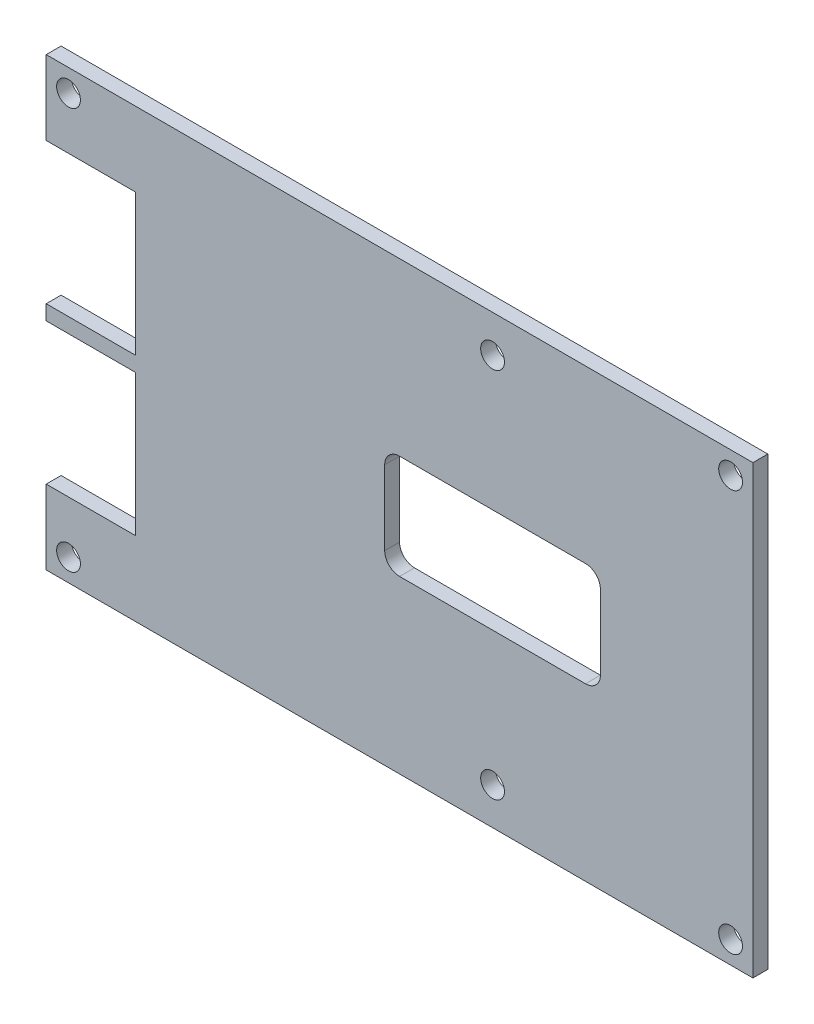
ISO-10303-21;
HEADER;
FILE_DESCRIPTION(('STEP AP214'),'2;1');
FILE_NAME('part.step','',(''),(''),'','','');
FILE_SCHEMA(('AUTOMOTIVE_DESIGN { 1 0 10303 214 1 1 1 1 }'));
ENDSEC;
DATA;
#1=APPLICATION_CONTEXT('core data for automotive mechanical design processes');
#2=APPLICATION_PROTOCOL_DEFINITION('international standard','automotive_design',2000,#1);
#3=PRODUCT_CONTEXT('',#1,'mechanical');
#4=PRODUCT('Part','Part','',(#3));
#5=PRODUCT_RELATED_PRODUCT_CATEGORY('part','',(#4));
#6=PRODUCT_DEFINITION_FORMATION('','',#4);
#7=PRODUCT_DEFINITION_CONTEXT('part definition',#1,'design');
#8=PRODUCT_DEFINITION('design','',#6,#7);
#9=PRODUCT_DEFINITION_SHAPE('','',#8);
#10=(LENGTH_UNIT() NAMED_UNIT(*) SI_UNIT(.MILLI.,.METRE.));
#11=(NAMED_UNIT(*) PLANE_ANGLE_UNIT() SI_UNIT($,.RADIAN.));
#12=(NAMED_UNIT(*) SI_UNIT($,.STERADIAN.) SOLID_ANGLE_UNIT());
#13=UNCERTAINTY_MEASURE_WITH_UNIT(LENGTH_MEASURE(1.E-05),#10,'distance_accuracy_value','');
#14=(GEOMETRIC_REPRESENTATION_CONTEXT(3) GLOBAL_UNCERTAINTY_ASSIGNED_CONTEXT((#13)) GLOBAL_UNIT_ASSIGNED_CONTEXT((#10,
#11,#12)) REPRESENTATION_CONTEXT('',''));
#15=CARTESIAN_POINT('',(0.,0.,0.));
#16=DIRECTION('',(0.,0.,1.));
#17=DIRECTION('',(1.,0.,0.));
#18=AXIS2_PLACEMENT_3D('',#15,#16,#17);
#19=CARTESIAN_POINT('',(0.,0.,2.));
#20=DIRECTION('',(0.,0.,1.));
#21=DIRECTION('',(1.,0.,0.));
#22=AXIS2_PLACEMENT_3D('',#19,#20,#21);
#23=PLANE('',#22);
#24=CARTESIAN_POINT('',(-36.5636368997673,-38.1185087890609,2.));
#25=DIRECTION('',(0.,0.,1.));
#26=DIRECTION('',(1.,0.,0.));
#27=AXIS2_PLACEMENT_3D('',#24,#25,#26);
#28=CIRCLE('',#27,1.6);
#29=CARTESIAN_POINT('',(-34.9636368997673,-38.1185087890609,2.));
#30=VERTEX_POINT('',#29);
#31=EDGE_CURVE('E243',#30,#30,#28,.T.);
#32=ORIENTED_EDGE('',*,*,#31,.F.);
#33=EDGE_LOOP('',(#32));
#34=FACE_BOUND('',#33,.T.);
#35=CARTESIAN_POINT('',(-36.5636368997673,15.8814912109391,2.));
#36=DIRECTION('',(0.,0.,1.));
#37=DIRECTION('',(1.,0.,0.));
#38=AXIS2_PLACEMENT_3D('',#35,#36,#37);
#39=CIRCLE('',#38,1.6);
#40=CARTESIAN_POINT('',(-34.9636368997673,15.8814912109391,2.));
#41=VERTEX_POINT('',#40);
#42=EDGE_CURVE('E255',#41,#41,#39,.T.);
#43=ORIENTED_EDGE('',*,*,#42,.F.);
#44=EDGE_LOOP('',(#43));
#45=FACE_BOUND('',#44,.T.);
#46=CARTESIAN_POINT('',(20.4363631002327,13.8814912109391,2.));
#47=DIRECTION('',(0.,0.,1.));
#48=DIRECTION('',(1.,0.,0.));
#49=AXIS2_PLACEMENT_3D('',#46,#47,#48);
#50=CIRCLE('',#49,1.6);
#51=CARTESIAN_POINT('',(22.0363631002327,13.8814912109391,2.));
#52=VERTEX_POINT('',#51);
#53=EDGE_CURVE('E267',#52,#52,#50,.T.);
#54=ORIENTED_EDGE('',*,*,#53,.F.);
#55=EDGE_LOOP('',(#54));
#56=FACE_BOUND('',#55,.T.);
#57=DIRECTION('',(0.,-1.,0.));
#58=VECTOR('',#57,1.);
#59=CARTESIAN_POINT('',(-39.5636368997673,18.8814912109391,2.));
#60=LINE('',#59,#58);
#61=CARTESIAN_POINT('',(-39.5636368997673,18.8814912109391,2.));
#62=VERTEX_POINT('',#61);
#63=CARTESIAN_POINT('',(-39.5636368997673,8.88149121093908,2.));
#64=VERTEX_POINT('',#63);
#65=EDGE_CURVE('E273',#62,#64,#60,.T.);
#66=ORIENTED_EDGE('',*,*,#65,.T.);
#67=DIRECTION('',(1.,0.,0.));
#68=VECTOR('',#67,1.);
#69=CARTESIAN_POINT('',(-39.5636368997673,8.88149121093908,2.));
#70=LINE('',#69,#68);
#71=CARTESIAN_POINT('',(-27.5636368997673,8.88149121093908,2.));
#72=VERTEX_POINT('',#71);
#73=EDGE_CURVE('E276',#64,#72,#70,.T.);
#74=ORIENTED_EDGE('',*,*,#73,.T.);
#75=DIRECTION('',(0.,-1.,0.));
#76=VECTOR('',#75,1.);
#77=CARTESIAN_POINT('',(-27.5636368997673,8.88149121093908,2.));
#78=LINE('',#77,#76);
#79=CARTESIAN_POINT('',(-27.5636368997673,-10.1185087890609,2.));
#80=VERTEX_POINT('',#79);
#81=EDGE_CURVE('E279',#72,#80,#78,.T.);
#82=ORIENTED_EDGE('',*,*,#81,.T.);
#83=DIRECTION('',(-1.,0.,0.));
#84=VECTOR('',#83,1.);
#85=CARTESIAN_POINT('',(-39.5636368997673,-10.1185087890609,2.));
#86=LINE('',#85,#84);
#87=CARTESIAN_POINT('',(-39.5636368997673,-10.1185087890609,2.));
#88=VERTEX_POINT('',#87);
#89=EDGE_CURVE('E281',#80,#88,#86,.T.);
#90=ORIENTED_EDGE('',*,*,#89,.T.);
#91=DIRECTION('',(0.,-1.,0.));
#92=VECTOR('',#91,1.);
#93=CARTESIAN_POINT('',(-39.5636368997673,-10.1185087890609,2.));
#94=LINE('',#93,#92);
#95=CARTESIAN_POINT('',(-39.5636368997673,-12.1185087890609,2.));
#96=VERTEX_POINT('',#95);
#97=EDGE_CURVE('E283',#88,#96,#94,.T.);
#98=ORIENTED_EDGE('',*,*,#97,.T.);
#99=DIRECTION('',(1.,0.,0.));
#100=VECTOR('',#99,1.);
#101=CARTESIAN_POINT('',(-39.5636368997673,-12.1185087890609,2.));
#102=LINE('',#101,#100);
#103=CARTESIAN_POINT('',(-27.5636368997673,-12.1185087890609,2.));
#104=VERTEX_POINT('',#103);
#105=EDGE_CURVE('E285',#96,#104,#102,.T.);
#106=ORIENTED_EDGE('',*,*,#105,.T.);
#107=DIRECTION('',(0.,-1.,0.));
#108=VECTOR('',#107,1.);
#109=CARTESIAN_POINT('',(-27.5636368997673,-12.1185087890609,2.));
#110=LINE('',#109,#108);
#111=CARTESIAN_POINT('',(-27.5636368997673,-31.1185087890609,2.));
#112=VERTEX_POINT('',#111);
#113=EDGE_CURVE('E287',#104,#112,#110,.T.);
#114=ORIENTED_EDGE('',*,*,#113,.T.);
#115=DIRECTION('',(-1.,0.,0.));
#116=VECTOR('',#115,1.);
#117=CARTESIAN_POINT('',(-39.5636368997673,-31.1185087890609,2.));
#118=LINE('',#117,#116);
#119=CARTESIAN_POINT('',(-39.5636368997673,-31.1185087890609,2.));
#120=VERTEX_POINT('',#119);
#121=EDGE_CURVE('E289',#112,#120,#118,.T.);
#122=ORIENTED_EDGE('',*,*,#121,.T.);
#123=DIRECTION('',(0.,-1.,0.));
#124=VECTOR('',#123,1.);
#125=CARTESIAN_POINT('',(-39.5636368997673,-31.1185087890609,2.));
#126=LINE('',#125,#124);
#127=CARTESIAN_POINT('',(-39.5636368997673,-41.1185087890609,2.));
#128=VERTEX_POINT('',#127);
#129=EDGE_CURVE('E291',#120,#128,#126,.T.);
#130=ORIENTED_EDGE('',*,*,#129,.T.);
#131=DIRECTION('',(1.,0.,0.));
#132=VECTOR('',#131,1.);
#133=CARTESIAN_POINT('',(-39.5636368997673,-41.1185087890609,2.));
#134=LINE('',#133,#132);
#135=CARTESIAN_POINT('',(55.4363631002327,-41.1185087890609,2.));
#136=VERTEX_POINT('',#135);
#137=EDGE_CURVE('E293',#128,#136,#134,.T.);
#138=ORIENTED_EDGE('',*,*,#137,.T.);
#139=DIRECTION('',(0.,1.,0.));
#140=VECTOR('',#139,1.);
#141=CARTESIAN_POINT('',(55.4363631002327,18.8814912109391,2.));
#142=LINE('',#141,#140);
#143=CARTESIAN_POINT('',(55.4363631002327,18.8814912109391,2.));
#144=VERTEX_POINT('',#143);
#145=EDGE_CURVE('E295',#136,#144,#142,.T.);
#146=ORIENTED_EDGE('',*,*,#145,.T.);
#147=DIRECTION('',(-1.,0.,0.));
#148=VECTOR('',#147,1.);
#149=CARTESIAN_POINT('',(-39.5636368997673,18.8814912109391,2.));
#150=LINE('',#149,#148);
#151=EDGE_CURVE('E297',#144,#62,#150,.T.);
#152=ORIENTED_EDGE('',*,*,#151,.T.);
#153=EDGE_LOOP('',(#66,#74,#82,#90,#98,#106,#114,#122,#130,#138,#146,#152));
#154=FACE_BOUND('',#153,.T.);
#155=CARTESIAN_POINT('',(20.4363631002327,-36.1185087890609,2.));
#156=DIRECTION('',(0.,0.,1.));
#157=DIRECTION('',(1.,0.,0.));
#158=AXIS2_PLACEMENT_3D('',#155,#156,#157);
#159=CIRCLE('',#158,1.6);
#160=CARTESIAN_POINT('',(22.0363631002327,-36.1185087890609,2.));
#161=VERTEX_POINT('',#160);
#162=EDGE_CURVE('E261',#161,#161,#159,.T.);
#163=ORIENTED_EDGE('',*,*,#162,.F.);
#164=EDGE_LOOP('',(#163));
#165=FACE_BOUND('',#164,.T.);
#166=CARTESIAN_POINT('',(52.4363631002327,15.8814912109391,2.));
#167=DIRECTION('',(0.,0.,1.));
#168=DIRECTION('',(1.,0.,0.));
#169=AXIS2_PLACEMENT_3D('',#166,#167,#168);
#170=CIRCLE('',#169,1.6);
#171=CARTESIAN_POINT('',(54.0363631002327,15.8814912109391,2.));
#172=VERTEX_POINT('',#171);
#173=EDGE_CURVE('E249',#172,#172,#170,.T.);
#174=ORIENTED_EDGE('',*,*,#173,.F.);
#175=EDGE_LOOP('',(#174));
#176=FACE_BOUND('',#175,.T.);
#177=CARTESIAN_POINT('',(52.4363631002327,-38.1185087890609,2.));
#178=DIRECTION('',(0.,0.,1.));
#179=DIRECTION('',(1.,0.,0.));
#180=AXIS2_PLACEMENT_3D('',#177,#178,#179);
#181=CIRCLE('',#180,1.6);
#182=CARTESIAN_POINT('',(54.0363631002327,-38.1185087890609,2.));
#183=VERTEX_POINT('',#182);
#184=EDGE_CURVE('E237',#183,#183,#181,.T.);
#185=ORIENTED_EDGE('',*,*,#184,.F.);
#186=EDGE_LOOP('',(#185));
#187=FACE_BOUND('',#186,.T.);
#188=DIRECTION('',(0.,-1.,0.));
#189=VECTOR('',#188,1.);
#190=CARTESIAN_POINT('',(5.93636310023267,-6.11850878906092,2.));
#191=LINE('',#190,#189);
#192=CARTESIAN_POINT('',(5.93636310023267,-6.11850878906092,2.));
#193=VERTEX_POINT('',#192);
#194=CARTESIAN_POINT('',(5.93636310023267,-16.1185087890609,2.));
#195=VERTEX_POINT('',#194);
#196=EDGE_CURVE('E180',#193,#195,#191,.T.);
#197=ORIENTED_EDGE('',*,*,#196,.F.);
#198=CARTESIAN_POINT('',(7.93636310023267,-6.11850878906092,2.));
#199=DIRECTION('',(0.,0.,1.));
#200=DIRECTION('',(1.,0.,0.));
#201=AXIS2_PLACEMENT_3D('',#198,#199,#200);
#202=CIRCLE('',#201,2.);
#203=CARTESIAN_POINT('',(7.93636310023267,-4.11850878906092,2.));
#204=VERTEX_POINT('',#203);
#205=EDGE_CURVE('E172',#204,#193,#202,.T.);
#206=ORIENTED_EDGE('',*,*,#205,.F.);
#207=DIRECTION('',(-1.,0.,0.));
#208=VECTOR('',#207,1.);
#209=CARTESIAN_POINT('',(7.93636310023267,-4.11850878906092,2.));
#210=LINE('',#209,#208);
#211=CARTESIAN_POINT('',(32.9363631002327,-4.11850878906091,2.));
#212=VERTEX_POINT('',#211);
#213=EDGE_CURVE('E205',#212,#204,#210,.T.);
#214=ORIENTED_EDGE('',*,*,#213,.F.);
#215=CARTESIAN_POINT('',(32.9363631002327,-6.11850878906092,2.));
#216=DIRECTION('',(0.,0.,1.));
#217=DIRECTION('',(1.,0.,0.));
#218=AXIS2_PLACEMENT_3D('',#215,#216,#217);
#219=CIRCLE('',#218,2.);
#220=CARTESIAN_POINT('',(34.9363631002327,-6.11850878906092,2.));
#221=VERTEX_POINT('',#220);
#222=EDGE_CURVE('E203',#221,#212,#219,.T.);
#223=ORIENTED_EDGE('',*,*,#222,.F.);
#224=DIRECTION('',(0.,1.,0.));
#225=VECTOR('',#224,1.);
#226=CARTESIAN_POINT('',(34.9363631002327,-6.11850878906092,2.));
#227=LINE('',#226,#225);
#228=CARTESIAN_POINT('',(34.9363631002327,-16.1185087890609,2.));
#229=VERTEX_POINT('',#228);
#230=EDGE_CURVE('E201',#229,#221,#227,.T.);
#231=ORIENTED_EDGE('',*,*,#230,.F.);
#232=CARTESIAN_POINT('',(32.9363631002327,-16.1185087890609,2.));
#233=DIRECTION('',(0.,0.,1.));
#234=DIRECTION('',(1.,0.,0.));
#235=AXIS2_PLACEMENT_3D('',#232,#233,#234);
#236=CIRCLE('',#235,2.);
#237=CARTESIAN_POINT('',(32.9363631002327,-18.1185087890609,2.));
#238=VERTEX_POINT('',#237);
#239=EDGE_CURVE('E199',#238,#229,#236,.T.);
#240=ORIENTED_EDGE('',*,*,#239,.F.);
#241=DIRECTION('',(1.,0.,0.));
#242=VECTOR('',#241,1.);
#243=CARTESIAN_POINT('',(7.93636310023267,-18.1185087890609,2.));
#244=LINE('',#243,#242);
#245=CARTESIAN_POINT('',(7.93636310023267,-18.1185087890609,2.));
#246=VERTEX_POINT('',#245);
#247=EDGE_CURVE('E195',#246,#238,#244,.T.);
#248=ORIENTED_EDGE('',*,*,#247,.F.);
#249=CARTESIAN_POINT('',(7.93636310023267,-16.1185087890609,2.));
#250=DIRECTION('',(0.,0.,1.));
#251=DIRECTION('',(-1.,0.,0.));
#252=AXIS2_PLACEMENT_3D('',#249,#250,#251);
#253=CIRCLE('',#252,2.);
#254=EDGE_CURVE('E193',#195,#246,#253,.T.);
#255=ORIENTED_EDGE('',*,*,#254,.F.);
#256=EDGE_LOOP('',(#197,#206,#214,#223,#231,#240,#248,#255));
#257=FACE_BOUND('',#256,.T.);
#258=ADVANCED_FACE('F35',(#34,#45,#56,#154,#165,#176,#187,#257),#23,.T.);
#259=CARTESIAN_POINT('',(0.,0.,0.));
#260=DIRECTION('',(0.,0.,1.));
#261=DIRECTION('',(1.,0.,0.));
#262=AXIS2_PLACEMENT_3D('',#259,#260,#261);
#263=PLANE('',#262);
#264=CARTESIAN_POINT('',(52.4363631002327,-38.1185087890609,0.));
#265=DIRECTION('',(0.,0.,1.));
#266=DIRECTION('',(1.,0.,0.));
#267=AXIS2_PLACEMENT_3D('',#264,#265,#266);
#268=CIRCLE('',#267,1.6);
#269=CARTESIAN_POINT('',(54.0363631002327,-38.1185087890609,0.));
#270=VERTEX_POINT('',#269);
#271=EDGE_CURVE('E188',#270,#270,#268,.T.);
#272=ORIENTED_EDGE('',*,*,#271,.T.);
#273=EDGE_LOOP('',(#272));
#274=FACE_BOUND('',#273,.T.);
#275=CARTESIAN_POINT('',(-36.5636368997673,-38.1185087890609,0.));
#276=DIRECTION('',(0.,0.,1.));
#277=DIRECTION('',(1.,0.,0.));
#278=AXIS2_PLACEMENT_3D('',#275,#276,#277);
#279=CIRCLE('',#278,1.6);
#280=CARTESIAN_POINT('',(-34.9636368997673,-38.1185087890609,0.));
#281=VERTEX_POINT('',#280);
#282=EDGE_CURVE('E240',#281,#281,#279,.T.);
#283=ORIENTED_EDGE('',*,*,#282,.T.);
#284=EDGE_LOOP('',(#283));
#285=FACE_BOUND('',#284,.T.);
#286=CARTESIAN_POINT('',(52.4363631002327,15.8814912109391,0.));
#287=DIRECTION('',(0.,0.,1.));
#288=DIRECTION('',(1.,0.,0.));
#289=AXIS2_PLACEMENT_3D('',#286,#287,#288);
#290=CIRCLE('',#289,1.6);
#291=CARTESIAN_POINT('',(54.0363631002327,15.8814912109391,0.));
#292=VERTEX_POINT('',#291);
#293=EDGE_CURVE('E246',#292,#292,#290,.T.);
#294=ORIENTED_EDGE('',*,*,#293,.T.);
#295=EDGE_LOOP('',(#294));
#296=FACE_BOUND('',#295,.T.);
#297=CARTESIAN_POINT('',(-36.5636368997673,15.8814912109391,0.));
#298=DIRECTION('',(0.,0.,1.));
#299=DIRECTION('',(1.,0.,0.));
#300=AXIS2_PLACEMENT_3D('',#297,#298,#299);
#301=CIRCLE('',#300,1.6);
#302=CARTESIAN_POINT('',(-34.9636368997673,15.8814912109391,0.));
#303=VERTEX_POINT('',#302);
#304=EDGE_CURVE('E252',#303,#303,#301,.T.);
#305=ORIENTED_EDGE('',*,*,#304,.T.);
#306=EDGE_LOOP('',(#305));
#307=FACE_BOUND('',#306,.T.);
#308=CARTESIAN_POINT('',(20.4363631002327,-36.1185087890609,0.));
#309=DIRECTION('',(0.,0.,1.));
#310=DIRECTION('',(1.,0.,0.));
#311=AXIS2_PLACEMENT_3D('',#308,#309,#310);
#312=CIRCLE('',#311,1.6);
#313=CARTESIAN_POINT('',(22.0363631002327,-36.1185087890609,0.));
#314=VERTEX_POINT('',#313);
#315=EDGE_CURVE('E258',#314,#314,#312,.T.);
#316=ORIENTED_EDGE('',*,*,#315,.T.);
#317=EDGE_LOOP('',(#316));
#318=FACE_BOUND('',#317,.T.);
#319=CARTESIAN_POINT('',(20.4363631002327,13.8814912109391,0.));
#320=DIRECTION('',(0.,0.,1.));
#321=DIRECTION('',(1.,0.,0.));
#322=AXIS2_PLACEMENT_3D('',#319,#320,#321);
#323=CIRCLE('',#322,1.6);
#324=CARTESIAN_POINT('',(22.0363631002327,13.8814912109391,0.));
#325=VERTEX_POINT('',#324);
#326=EDGE_CURVE('E264',#325,#325,#323,.T.);
#327=ORIENTED_EDGE('',*,*,#326,.T.);
#328=EDGE_LOOP('',(#327));
#329=FACE_BOUND('',#328,.T.);
#330=DIRECTION('',(0.,-1.,0.));
#331=VECTOR('',#330,1.);
#332=CARTESIAN_POINT('',(-39.5636368997673,18.8814912109391,0.));
#333=LINE('',#332,#331);
#334=CARTESIAN_POINT('',(-39.5636368997673,18.8814912109391,0.));
#335=VERTEX_POINT('',#334);
#336=CARTESIAN_POINT('',(-39.5636368997673,8.88149121093908,0.));
#337=VERTEX_POINT('',#336);
#338=EDGE_CURVE('E270',#335,#337,#333,.T.);
#339=ORIENTED_EDGE('',*,*,#338,.F.);
#340=DIRECTION('',(-1.,0.,0.));
#341=VECTOR('',#340,1.);
#342=CARTESIAN_POINT('',(-39.5636368997673,18.8814912109391,0.));
#343=LINE('',#342,#341);
#344=CARTESIAN_POINT('',(55.4363631002327,18.8814912109391,0.));
#345=VERTEX_POINT('',#344);
#346=EDGE_CURVE('E277',#345,#335,#343,.T.);
#347=ORIENTED_EDGE('',*,*,#346,.F.);
#348=DIRECTION('',(0.,1.,0.));
#349=VECTOR('',#348,1.);
#350=CARTESIAN_POINT('',(55.4363631002327,18.8814912109391,0.));
#351=LINE('',#350,#349);
#352=CARTESIAN_POINT('',(55.4363631002327,-41.1185087890609,0.));
#353=VERTEX_POINT('',#352);
#354=EDGE_CURVE('E320',#353,#345,#351,.T.);
#355=ORIENTED_EDGE('',*,*,#354,.F.);
#356=DIRECTION('',(1.,0.,0.));
#357=VECTOR('',#356,1.);
#358=CARTESIAN_POINT('',(-39.5636368997673,-41.1185087890609,0.));
#359=LINE('',#358,#357);
#360=CARTESIAN_POINT('',(-39.5636368997673,-41.1185087890609,0.));
#361=VERTEX_POINT('',#360);
#362=EDGE_CURVE('E318',#361,#353,#359,.T.);
#363=ORIENTED_EDGE('',*,*,#362,.F.);
#364=DIRECTION('',(0.,-1.,0.));
#365=VECTOR('',#364,1.);
#366=CARTESIAN_POINT('',(-39.5636368997673,-31.1185087890609,0.));
#367=LINE('',#366,#365);
#368=CARTESIAN_POINT('',(-39.5636368997673,-31.1185087890609,0.));
#369=VERTEX_POINT('',#368);
#370=EDGE_CURVE('E316',#369,#361,#367,.T.);
#371=ORIENTED_EDGE('',*,*,#370,.F.);
#372=DIRECTION('',(-1.,0.,0.));
#373=VECTOR('',#372,1.);
#374=CARTESIAN_POINT('',(-39.5636368997673,-31.1185087890609,0.));
#375=LINE('',#374,#373);
#376=CARTESIAN_POINT('',(-27.5636368997673,-31.1185087890609,0.));
#377=VERTEX_POINT('',#376);
#378=EDGE_CURVE('E314',#377,#369,#375,.T.);
#379=ORIENTED_EDGE('',*,*,#378,.F.);
#380=DIRECTION('',(0.,-1.,0.));
#381=VECTOR('',#380,1.);
#382=CARTESIAN_POINT('',(-27.5636368997673,-12.1185087890609,0.));
#383=LINE('',#382,#381);
#384=CARTESIAN_POINT('',(-27.5636368997673,-12.1185087890609,0.));
#385=VERTEX_POINT('',#384);
#386=EDGE_CURVE('E312',#385,#377,#383,.T.);
#387=ORIENTED_EDGE('',*,*,#386,.F.);
#388=DIRECTION('',(1.,0.,0.));
#389=VECTOR('',#388,1.);
#390=CARTESIAN_POINT('',(-39.5636368997673,-12.1185087890609,0.));
#391=LINE('',#390,#389);
#392=CARTESIAN_POINT('',(-39.5636368997673,-12.1185087890609,0.));
#393=VERTEX_POINT('',#392);
#394=EDGE_CURVE('E310',#393,#385,#391,.T.);
#395=ORIENTED_EDGE('',*,*,#394,.F.);
#396=DIRECTION('',(0.,-1.,0.));
#397=VECTOR('',#396,1.);
#398=CARTESIAN_POINT('',(-39.5636368997673,-10.1185087890609,0.));
#399=LINE('',#398,#397);
#400=CARTESIAN_POINT('',(-39.5636368997673,-10.1185087890609,0.));
#401=VERTEX_POINT('',#400);
#402=EDGE_CURVE('E308',#401,#393,#399,.T.);
#403=ORIENTED_EDGE('',*,*,#402,.F.);
#404=DIRECTION('',(-1.,0.,0.));
#405=VECTOR('',#404,1.);
#406=CARTESIAN_POINT('',(-39.5636368997673,-10.1185087890609,0.));
#407=LINE('',#406,#405);
#408=CARTESIAN_POINT('',(-27.5636368997673,-10.1185087890609,0.));
#409=VERTEX_POINT('',#408);
#410=EDGE_CURVE('E306',#409,#401,#407,.T.);
#411=ORIENTED_EDGE('',*,*,#410,.F.);
#412=DIRECTION('',(0.,-1.,0.));
#413=VECTOR('',#412,1.);
#414=CARTESIAN_POINT('',(-27.5636368997673,8.88149121093908,0.));
#415=LINE('',#414,#413);
#416=CARTESIAN_POINT('',(-27.5636368997673,8.88149121093908,0.));
#417=VERTEX_POINT('',#416);
#418=EDGE_CURVE('E304',#417,#409,#415,.T.);
#419=ORIENTED_EDGE('',*,*,#418,.F.);
#420=DIRECTION('',(1.,0.,0.));
#421=VECTOR('',#420,1.);
#422=CARTESIAN_POINT('',(-39.5636368997673,8.88149121093908,0.));
#423=LINE('',#422,#421);
#424=EDGE_CURVE('E302',#337,#417,#423,.T.);
#425=ORIENTED_EDGE('',*,*,#424,.F.);
#426=EDGE_LOOP('',(#339,#347,#355,#363,#371,#379,#387,#395,#403,#411,#419,#425));
#427=FACE_BOUND('',#426,.T.);
#428=CARTESIAN_POINT('',(7.93636310023267,-6.11850878906092,0.));
#429=DIRECTION('',(0.,0.,1.));
#430=DIRECTION('',(1.,0.,0.));
#431=AXIS2_PLACEMENT_3D('',#428,#429,#430);
#432=CIRCLE('',#431,2.);
#433=CARTESIAN_POINT('',(7.93636310023267,-4.11850878906092,0.));
#434=VERTEX_POINT('',#433);
#435=CARTESIAN_POINT('',(5.93636310023267,-6.11850878906092,0.));
#436=VERTEX_POINT('',#435);
#437=EDGE_CURVE('E58',#434,#436,#432,.T.);
#438=ORIENTED_EDGE('',*,*,#437,.T.);
#439=DIRECTION('',(0.,-1.,0.));
#440=VECTOR('',#439,1.);
#441=CARTESIAN_POINT('',(5.93636310023267,-6.11850878906092,0.));
#442=LINE('',#441,#440);
#443=CARTESIAN_POINT('',(5.93636310023267,-16.1185087890609,0.));
#444=VERTEX_POINT('',#443);
#445=EDGE_CURVE('E187',#436,#444,#442,.T.);
#446=ORIENTED_EDGE('',*,*,#445,.T.);
#447=CARTESIAN_POINT('',(7.93636310023267,-16.1185087890609,0.));
#448=DIRECTION('',(0.,0.,1.));
#449=DIRECTION('',(-1.,0.,0.));
#450=AXIS2_PLACEMENT_3D('',#447,#448,#449);
#451=CIRCLE('',#450,2.);
#452=CARTESIAN_POINT('',(7.93636310023267,-18.1185087890609,0.));
#453=VERTEX_POINT('',#452);
#454=EDGE_CURVE('E209',#444,#453,#451,.T.);
#455=ORIENTED_EDGE('',*,*,#454,.T.);
#456=DIRECTION('',(1.,0.,0.));
#457=VECTOR('',#456,1.);
#458=CARTESIAN_POINT('',(7.93636310023267,-18.1185087890609,0.));
#459=LINE('',#458,#457);
#460=CARTESIAN_POINT('',(32.9363631002327,-18.1185087890609,0.));
#461=VERTEX_POINT('',#460);
#462=EDGE_CURVE('E212',#453,#461,#459,.T.);
#463=ORIENTED_EDGE('',*,*,#462,.T.);
#464=CARTESIAN_POINT('',(32.9363631002327,-16.1185087890609,0.));
#465=DIRECTION('',(0.,0.,1.));
#466=DIRECTION('',(1.,0.,0.));
#467=AXIS2_PLACEMENT_3D('',#464,#465,#466);
#468=CIRCLE('',#467,2.);
#469=CARTESIAN_POINT('',(34.9363631002327,-16.1185087890609,0.));
#470=VERTEX_POINT('',#469);
#471=EDGE_CURVE('E215',#461,#470,#468,.T.);
#472=ORIENTED_EDGE('',*,*,#471,.T.);
#473=DIRECTION('',(0.,1.,0.));
#474=VECTOR('',#473,1.);
#475=CARTESIAN_POINT('',(34.9363631002327,-6.11850878906092,0.));
#476=LINE('',#475,#474);
#477=CARTESIAN_POINT('',(34.9363631002327,-6.11850878906092,0.));
#478=VERTEX_POINT('',#477);
#479=EDGE_CURVE('E218',#470,#478,#476,.T.);
#480=ORIENTED_EDGE('',*,*,#479,.T.);
#481=CARTESIAN_POINT('',(32.9363631002327,-6.11850878906092,0.));
#482=DIRECTION('',(0.,0.,1.));
#483=DIRECTION('',(1.,0.,0.));
#484=AXIS2_PLACEMENT_3D('',#481,#482,#483);
#485=CIRCLE('',#484,2.);
#486=CARTESIAN_POINT('',(32.9363631002327,-4.11850878906091,0.));
#487=VERTEX_POINT('',#486);
#488=EDGE_CURVE('E221',#478,#487,#485,.T.);
#489=ORIENTED_EDGE('',*,*,#488,.T.);
#490=DIRECTION('',(-1.,0.,0.));
#491=VECTOR('',#490,1.);
#492=CARTESIAN_POINT('',(7.93636310023267,-4.11850878906092,0.));
#493=LINE('',#492,#491);
#494=EDGE_CURVE('E181',#487,#434,#493,.T.);
#495=ORIENTED_EDGE('',*,*,#494,.T.);
#496=EDGE_LOOP('',(#438,#446,#455,#463,#472,#480,#489,#495));
#497=FACE_BOUND('',#496,.T.);
#498=ADVANCED_FACE('F362',(#274,#285,#296,#307,#318,#329,#427,#497),#263,.F.);
#499=CARTESIAN_POINT('',(-39.5636368997673,18.8814912109391,2.));
#500=DIRECTION('',(1.,0.,0.));
#501=DIRECTION('',(0.,0.,-1.));
#502=AXIS2_PLACEMENT_3D('',#499,#500,#501);
#503=PLANE('',#502);
#504=ORIENTED_EDGE('',*,*,#338,.T.);
#505=DIRECTION('',(0.,0.,-1.));
#506=VECTOR('',#505,1.);
#507=CARTESIAN_POINT('',(-39.5636368997673,8.88149121093908,2.));
#508=LINE('',#507,#506);
#509=EDGE_CURVE('E11',#64,#337,#508,.T.);
#510=ORIENTED_EDGE('',*,*,#509,.F.);
#511=ORIENTED_EDGE('',*,*,#65,.F.);
#512=DIRECTION('',(0.,0.,-1.));
#513=VECTOR('',#512,1.);
#514=CARTESIAN_POINT('',(-39.5636368997673,18.8814912109391,2.));
#515=LINE('',#514,#513);
#516=EDGE_CURVE('E299',#62,#335,#515,.T.);
#517=ORIENTED_EDGE('',*,*,#516,.T.);
#518=EDGE_LOOP('',(#504,#510,#511,#517));
#519=FACE_BOUND('',#518,.T.);
#520=ADVANCED_FACE('F37',(#519),#503,.F.);
#521=CARTESIAN_POINT('',(-39.5636368997673,8.88149121093908,2.));
#522=DIRECTION('',(0.,1.,0.));
#523=DIRECTION('',(0.,0.,1.));
#524=AXIS2_PLACEMENT_3D('',#521,#522,#523);
#525=PLANE('',#524);
#526=ORIENTED_EDGE('',*,*,#424,.T.);
#527=DIRECTION('',(0.,0.,-1.));
#528=VECTOR('',#527,1.);
#529=CARTESIAN_POINT('',(-27.5636368997673,8.88149121093908,2.));
#530=LINE('',#529,#528);
#531=EDGE_CURVE('E43',#72,#417,#530,.T.);
#532=ORIENTED_EDGE('',*,*,#531,.F.);
#533=ORIENTED_EDGE('',*,*,#73,.F.);
#534=ORIENTED_EDGE('',*,*,#509,.T.);
#535=EDGE_LOOP('',(#526,#532,#533,#534));
#536=FACE_BOUND('',#535,.T.);
#537=ADVANCED_FACE('F380',(#536),#525,.F.);
#538=CARTESIAN_POINT('',(-27.5636368997673,8.88149121093908,2.));
#539=DIRECTION('',(1.,0.,0.));
#540=DIRECTION('',(0.,1.,0.));
#541=AXIS2_PLACEMENT_3D('',#538,#539,#540);
#542=PLANE('',#541);
#543=ORIENTED_EDGE('',*,*,#418,.T.);
#544=DIRECTION('',(0.,0.,-1.));
#545=VECTOR('',#544,1.);
#546=CARTESIAN_POINT('',(-27.5636368997673,-10.1185087890609,2.));
#547=LINE('',#546,#545);
#548=EDGE_CURVE('E349',#80,#409,#547,.T.);
#549=ORIENTED_EDGE('',*,*,#548,.F.);
#550=ORIENTED_EDGE('',*,*,#81,.F.);
#551=ORIENTED_EDGE('',*,*,#531,.T.);
#552=EDGE_LOOP('',(#543,#549,#550,#551));
#553=FACE_BOUND('',#552,.T.);
#554=ADVANCED_FACE('F356',(#553),#542,.F.);
#555=CARTESIAN_POINT('',(-39.5636368997673,-10.1185087890609,2.));
#556=DIRECTION('',(0.,-1.,0.));
#557=DIRECTION('',(0.,0.,-1.));
#558=AXIS2_PLACEMENT_3D('',#555,#556,#557);
#559=PLANE('',#558);
#560=ORIENTED_EDGE('',*,*,#410,.T.);
#561=DIRECTION('',(0.,0.,-1.));
#562=VECTOR('',#561,1.);
#563=CARTESIAN_POINT('',(-39.5636368997673,-10.1185087890609,2.));
#564=LINE('',#563,#562);
#565=EDGE_CURVE('E346',#88,#401,#564,.T.);
#566=ORIENTED_EDGE('',*,*,#565,.F.);
#567=ORIENTED_EDGE('',*,*,#89,.F.);
#568=ORIENTED_EDGE('',*,*,#548,.T.);
#569=EDGE_LOOP('',(#560,#566,#567,#568));
#570=FACE_BOUND('',#569,.T.);
#571=ADVANCED_FACE('F368',(#570),#559,.F.);
#572=CARTESIAN_POINT('',(-39.5636368997673,-10.1185087890609,2.));
#573=DIRECTION('',(1.,0.,0.));
#574=DIRECTION('',(0.,1.,0.));
#575=AXIS2_PLACEMENT_3D('',#572,#573,#574);
#576=PLANE('',#575);
#577=ORIENTED_EDGE('',*,*,#402,.T.);
#578=DIRECTION('',(0.,0.,-1.));
#579=VECTOR('',#578,1.);
#580=CARTESIAN_POINT('',(-39.5636368997673,-12.1185087890609,2.));
#581=LINE('',#580,#579);
#582=EDGE_CURVE('E343',#96,#393,#581,.T.);
#583=ORIENTED_EDGE('',*,*,#582,.F.);
#584=ORIENTED_EDGE('',*,*,#97,.F.);
#585=ORIENTED_EDGE('',*,*,#565,.T.);
#586=EDGE_LOOP('',(#577,#583,#584,#585));
#587=FACE_BOUND('',#586,.T.);
#588=ADVANCED_FACE('F372',(#587),#576,.F.);
#589=CARTESIAN_POINT('',(-39.5636368997673,-12.1185087890609,2.));
#590=DIRECTION('',(0.,1.,0.));
#591=DIRECTION('',(0.,0.,1.));
#592=AXIS2_PLACEMENT_3D('',#589,#590,#591);
#593=PLANE('',#592);
#594=ORIENTED_EDGE('',*,*,#394,.T.);
#595=DIRECTION('',(0.,0.,-1.));
#596=VECTOR('',#595,1.);
#597=CARTESIAN_POINT('',(-27.5636368997673,-12.1185087890609,2.));
#598=LINE('',#597,#596);
#599=EDGE_CURVE('E340',#104,#385,#598,.T.);
#600=ORIENTED_EDGE('',*,*,#599,.F.);
#601=ORIENTED_EDGE('',*,*,#105,.F.);
#602=ORIENTED_EDGE('',*,*,#582,.T.);
#603=EDGE_LOOP('',(#594,#600,#601,#602));
#604=FACE_BOUND('',#603,.T.);
#605=ADVANCED_FACE('F413',(#604),#593,.F.);
#606=CARTESIAN_POINT('',(-27.5636368997673,-12.1185087890609,2.));
#607=DIRECTION('',(1.,0.,0.));
#608=DIRECTION('',(0.,0.,-1.));
#609=AXIS2_PLACEMENT_3D('',#606,#607,#608);
#610=PLANE('',#609);
#611=ORIENTED_EDGE('',*,*,#386,.T.);
#612=DIRECTION('',(0.,0.,-1.));
#613=VECTOR('',#612,1.);
#614=CARTESIAN_POINT('',(-27.5636368997673,-31.1185087890609,2.));
#615=LINE('',#614,#613);
#616=EDGE_CURVE('E337',#112,#377,#615,.T.);
#617=ORIENTED_EDGE('',*,*,#616,.F.);
#618=ORIENTED_EDGE('',*,*,#113,.F.);
#619=ORIENTED_EDGE('',*,*,#599,.T.);
#620=EDGE_LOOP('',(#611,#617,#618,#619));
#621=FACE_BOUND('',#620,.T.);
#622=ADVANCED_FACE('F411',(#621),#610,.F.);
#623=CARTESIAN_POINT('',(-39.5636368997673,-31.1185087890609,2.));
#624=DIRECTION('',(0.,-1.,0.));
#625=DIRECTION('',(0.,0.,-1.));
#626=AXIS2_PLACEMENT_3D('',#623,#624,#625);
#627=PLANE('',#626);
#628=ORIENTED_EDGE('',*,*,#378,.T.);
#629=DIRECTION('',(0.,0.,-1.));
#630=VECTOR('',#629,1.);
#631=CARTESIAN_POINT('',(-39.5636368997673,-31.1185087890609,2.));
#632=LINE('',#631,#630);
#633=EDGE_CURVE('E334',#120,#369,#632,.T.);
#634=ORIENTED_EDGE('',*,*,#633,.F.);
#635=ORIENTED_EDGE('',*,*,#121,.F.);
#636=ORIENTED_EDGE('',*,*,#616,.T.);
#637=EDGE_LOOP('',(#628,#634,#635,#636));
#638=FACE_BOUND('',#637,.T.);
#639=ADVANCED_FACE('F407',(#638),#627,.F.);
#640=CARTESIAN_POINT('',(-39.5636368997673,-31.1185087890609,2.));
#641=DIRECTION('',(1.,0.,0.));
#642=DIRECTION('',(0.,1.,0.));
#643=AXIS2_PLACEMENT_3D('',#640,#641,#642);
#644=PLANE('',#643);
#645=ORIENTED_EDGE('',*,*,#370,.T.);
#646=DIRECTION('',(0.,0.,-1.));
#647=VECTOR('',#646,1.);
#648=CARTESIAN_POINT('',(-39.5636368997673,-41.1185087890609,2.));
#649=LINE('',#648,#647);
#650=EDGE_CURVE('E331',#128,#361,#649,.T.);
#651=ORIENTED_EDGE('',*,*,#650,.F.);
#652=ORIENTED_EDGE('',*,*,#129,.F.);
#653=ORIENTED_EDGE('',*,*,#633,.T.);
#654=EDGE_LOOP('',(#645,#651,#652,#653));
#655=FACE_BOUND('',#654,.T.);
#656=ADVANCED_FACE('F402',(#655),#644,.F.);
#657=CARTESIAN_POINT('',(-39.5636368997673,-41.1185087890609,2.));
#658=DIRECTION('',(0.,1.,0.));
#659=DIRECTION('',(0.,0.,1.));
#660=AXIS2_PLACEMENT_3D('',#657,#658,#659);
#661=PLANE('',#660);
#662=ORIENTED_EDGE('',*,*,#362,.T.);
#663=DIRECTION('',(0.,0.,-1.));
#664=VECTOR('',#663,1.);
#665=CARTESIAN_POINT('',(55.4363631002327,-41.1185087890609,2.));
#666=LINE('',#665,#664);
#667=EDGE_CURVE('E328',#136,#353,#666,.T.);
#668=ORIENTED_EDGE('',*,*,#667,.F.);
#669=ORIENTED_EDGE('',*,*,#137,.F.);
#670=ORIENTED_EDGE('',*,*,#650,.T.);
#671=EDGE_LOOP('',(#662,#668,#669,#670));
#672=FACE_BOUND('',#671,.T.);
#673=ADVANCED_FACE('F396',(#672),#661,.F.);
#674=CARTESIAN_POINT('',(55.4363631002327,18.8814912109391,2.));
#675=DIRECTION('',(-1.,0.,0.));
#676=DIRECTION('',(0.,-1.,0.));
#677=AXIS2_PLACEMENT_3D('',#674,#675,#676);
#678=PLANE('',#677);
#679=ORIENTED_EDGE('',*,*,#354,.T.);
#680=DIRECTION('',(0.,0.,-1.));
#681=VECTOR('',#680,1.);
#682=CARTESIAN_POINT('',(55.4363631002327,18.8814912109391,2.));
#683=LINE('',#682,#681);
#684=EDGE_CURVE('E325',#144,#345,#683,.T.);
#685=ORIENTED_EDGE('',*,*,#684,.F.);
#686=ORIENTED_EDGE('',*,*,#145,.F.);
#687=ORIENTED_EDGE('',*,*,#667,.T.);
#688=EDGE_LOOP('',(#679,#685,#686,#687));
#689=FACE_BOUND('',#688,.T.);
#690=ADVANCED_FACE('F392',(#689),#678,.F.);
#691=CARTESIAN_POINT('',(-39.5636368997673,18.8814912109391,2.));
#692=DIRECTION('',(0.,-1.,0.));
#693=DIRECTION('',(1.,0.,0.));
#694=AXIS2_PLACEMENT_3D('',#691,#692,#693);
#695=PLANE('',#694);
#696=ORIENTED_EDGE('',*,*,#346,.T.);
#697=ORIENTED_EDGE('',*,*,#516,.F.);
#698=ORIENTED_EDGE('',*,*,#151,.F.);
#699=ORIENTED_EDGE('',*,*,#684,.T.);
#700=EDGE_LOOP('',(#696,#697,#698,#699));
#701=FACE_BOUND('',#700,.T.);
#702=ADVANCED_FACE('F387',(#701),#695,.F.);
#703=CARTESIAN_POINT('',(20.4363631002327,13.8814912109391,2.));
#704=DIRECTION('',(0.,0.,-1.));
#705=DIRECTION('',(-1.,0.,0.));
#706=AXIS2_PLACEMENT_3D('',#703,#704,#705);
#707=CYLINDRICAL_SURFACE('',#706,1.6);
#708=ORIENTED_EDGE('',*,*,#53,.T.);
#709=EDGE_LOOP('',(#708));
#710=FACE_BOUND('',#709,.T.);
#711=ORIENTED_EDGE('',*,*,#326,.F.);
#712=EDGE_LOOP('',(#711));
#713=FACE_BOUND('',#712,.T.);
#714=ADVANCED_FACE('F433',(#710,#713),#707,.F.);
#715=CARTESIAN_POINT('',(20.4363631002327,-36.1185087890609,2.));
#716=DIRECTION('',(0.,0.,-1.));
#717=DIRECTION('',(-1.,0.,0.));
#718=AXIS2_PLACEMENT_3D('',#715,#716,#717);
#719=CYLINDRICAL_SURFACE('',#718,1.6);
#720=ORIENTED_EDGE('',*,*,#162,.T.);
#721=EDGE_LOOP('',(#720));
#722=FACE_BOUND('',#721,.T.);
#723=ORIENTED_EDGE('',*,*,#315,.F.);
#724=EDGE_LOOP('',(#723));
#725=FACE_BOUND('',#724,.T.);
#726=ADVANCED_FACE('F471',(#722,#725),#719,.F.);
#727=CARTESIAN_POINT('',(-36.5636368997673,15.8814912109391,2.));
#728=DIRECTION('',(0.,0.,-1.));
#729=DIRECTION('',(-1.,0.,0.));
#730=AXIS2_PLACEMENT_3D('',#727,#728,#729);
#731=CYLINDRICAL_SURFACE('',#730,1.6);
#732=ORIENTED_EDGE('',*,*,#42,.T.);
#733=EDGE_LOOP('',(#732));
#734=FACE_BOUND('',#733,.T.);
#735=ORIENTED_EDGE('',*,*,#304,.F.);
#736=EDGE_LOOP('',(#735));
#737=FACE_BOUND('',#736,.T.);
#738=ADVANCED_FACE('F478',(#734,#737),#731,.F.);
#739=CARTESIAN_POINT('',(52.4363631002327,15.8814912109391,2.));
#740=DIRECTION('',(0.,0.,-1.));
#741=DIRECTION('',(-1.,0.,0.));
#742=AXIS2_PLACEMENT_3D('',#739,#740,#741);
#743=CYLINDRICAL_SURFACE('',#742,1.6);
#744=ORIENTED_EDGE('',*,*,#173,.T.);
#745=EDGE_LOOP('',(#744));
#746=FACE_BOUND('',#745,.T.);
#747=ORIENTED_EDGE('',*,*,#293,.F.);
#748=EDGE_LOOP('',(#747));
#749=FACE_BOUND('',#748,.T.);
#750=ADVANCED_FACE('F485',(#746,#749),#743,.F.);
#751=CARTESIAN_POINT('',(-36.5636368997673,-38.1185087890609,2.));
#752=DIRECTION('',(0.,0.,-1.));
#753=DIRECTION('',(-1.,0.,0.));
#754=AXIS2_PLACEMENT_3D('',#751,#752,#753);
#755=CYLINDRICAL_SURFACE('',#754,1.6);
#756=ORIENTED_EDGE('',*,*,#31,.T.);
#757=EDGE_LOOP('',(#756));
#758=FACE_BOUND('',#757,.T.);
#759=ORIENTED_EDGE('',*,*,#282,.F.);
#760=EDGE_LOOP('',(#759));
#761=FACE_BOUND('',#760,.T.);
#762=ADVANCED_FACE('F493',(#758,#761),#755,.F.);
#763=CARTESIAN_POINT('',(52.4363631002327,-38.1185087890609,2.));
#764=DIRECTION('',(0.,0.,-1.));
#765=DIRECTION('',(-1.,0.,0.));
#766=AXIS2_PLACEMENT_3D('',#763,#764,#765);
#767=CYLINDRICAL_SURFACE('',#766,1.6);
#768=ORIENTED_EDGE('',*,*,#184,.T.);
#769=EDGE_LOOP('',(#768));
#770=FACE_BOUND('',#769,.T.);
#771=ORIENTED_EDGE('',*,*,#271,.F.);
#772=EDGE_LOOP('',(#771));
#773=FACE_BOUND('',#772,.T.);
#774=ADVANCED_FACE('F501',(#770,#773),#767,.F.);
#775=CARTESIAN_POINT('',(7.93636310023267,-6.11850878906092,2.));
#776=DIRECTION('',(0.,0.,-1.));
#777=DIRECTION('',(-1.,0.,0.));
#778=AXIS2_PLACEMENT_3D('',#775,#776,#777);
#779=CYLINDRICAL_SURFACE('',#778,2.);
#780=ORIENTED_EDGE('',*,*,#437,.F.);
#781=DIRECTION('',(0.,0.,-1.));
#782=VECTOR('',#781,1.);
#783=CARTESIAN_POINT('',(7.93636310023267,-4.11850878906092,2.));
#784=LINE('',#783,#782);
#785=EDGE_CURVE('E176',#204,#434,#784,.T.);
#786=ORIENTED_EDGE('',*,*,#785,.F.);
#787=ORIENTED_EDGE('',*,*,#205,.T.);
#788=DIRECTION('',(0.,0.,-1.));
#789=VECTOR('',#788,1.);
#790=CARTESIAN_POINT('',(5.93636310023267,-6.11850878906092,2.));
#791=LINE('',#790,#789);
#792=EDGE_CURVE('E175',#193,#436,#791,.T.);
#793=ORIENTED_EDGE('',*,*,#792,.T.);
#794=EDGE_LOOP('',(#780,#786,#787,#793));
#795=FACE_BOUND('',#794,.T.);
#796=ADVANCED_FACE('F174',(#795),#779,.F.);
#797=CARTESIAN_POINT('',(5.93636310023267,-6.11850878906092,2.));
#798=DIRECTION('',(1.,0.,0.));
#799=DIRECTION('',(0.,1.,0.));
#800=AXIS2_PLACEMENT_3D('',#797,#798,#799);
#801=PLANE('',#800);
#802=ORIENTED_EDGE('',*,*,#445,.F.);
#803=ORIENTED_EDGE('',*,*,#792,.F.);
#804=ORIENTED_EDGE('',*,*,#196,.T.);
#805=DIRECTION('',(0.,0.,-1.));
#806=VECTOR('',#805,1.);
#807=CARTESIAN_POINT('',(5.93636310023267,-16.1185087890609,2.));
#808=LINE('',#807,#806);
#809=EDGE_CURVE('E189',#195,#444,#808,.T.);
#810=ORIENTED_EDGE('',*,*,#809,.T.);
#811=EDGE_LOOP('',(#802,#803,#804,#810));
#812=FACE_BOUND('',#811,.T.);
#813=ADVANCED_FACE('F184',(#812),#801,.T.);
#814=CARTESIAN_POINT('',(7.93636310023267,-16.1185087890609,2.));
#815=DIRECTION('',(0.,0.,-1.));
#816=DIRECTION('',(-1.,0.,0.));
#817=AXIS2_PLACEMENT_3D('',#814,#815,#816);
#818=CYLINDRICAL_SURFACE('',#817,2.);
#819=ORIENTED_EDGE('',*,*,#454,.F.);
#820=ORIENTED_EDGE('',*,*,#809,.F.);
#821=ORIENTED_EDGE('',*,*,#254,.T.);
#822=DIRECTION('',(0.,0.,-1.));
#823=VECTOR('',#822,1.);
#824=CARTESIAN_POINT('',(7.93636310023267,-18.1185087890609,2.));
#825=LINE('',#824,#823);
#826=EDGE_CURVE('E234',#246,#453,#825,.T.);
#827=ORIENTED_EDGE('',*,*,#826,.T.);
#828=EDGE_LOOP('',(#819,#820,#821,#827));
#829=FACE_BOUND('',#828,.T.);
#830=ADVANCED_FACE('F522',(#829),#818,.F.);
#831=CARTESIAN_POINT('',(7.93636310023267,-18.1185087890609,2.));
#832=DIRECTION('',(0.,1.,0.));
#833=DIRECTION('',(-1.,0.,0.));
#834=AXIS2_PLACEMENT_3D('',#831,#832,#833);
#835=PLANE('',#834);
#836=ORIENTED_EDGE('',*,*,#462,.F.);
#837=ORIENTED_EDGE('',*,*,#826,.F.);
#838=ORIENTED_EDGE('',*,*,#247,.T.);
#839=DIRECTION('',(0.,0.,-1.));
#840=VECTOR('',#839,1.);
#841=CARTESIAN_POINT('',(32.9363631002327,-18.1185087890609,2.));
#842=LINE('',#841,#840);
#843=EDGE_CURVE('E232',#238,#461,#842,.T.);
#844=ORIENTED_EDGE('',*,*,#843,.T.);
#845=EDGE_LOOP('',(#836,#837,#838,#844));
#846=FACE_BOUND('',#845,.T.);
#847=ADVANCED_FACE('F529',(#846),#835,.T.);
#848=CARTESIAN_POINT('',(32.9363631002327,-16.1185087890609,2.));
#849=DIRECTION('',(0.,0.,-1.));
#850=DIRECTION('',(-1.,0.,0.));
#851=AXIS2_PLACEMENT_3D('',#848,#849,#850);
#852=CYLINDRICAL_SURFACE('',#851,2.);
#853=ORIENTED_EDGE('',*,*,#471,.F.);
#854=ORIENTED_EDGE('',*,*,#843,.F.);
#855=ORIENTED_EDGE('',*,*,#239,.T.);
#856=DIRECTION('',(0.,0.,-1.));
#857=VECTOR('',#856,1.);
#858=CARTESIAN_POINT('',(34.9363631002327,-16.1185087890609,2.));
#859=LINE('',#858,#857);
#860=EDGE_CURVE('E230',#229,#470,#859,.T.);
#861=ORIENTED_EDGE('',*,*,#860,.T.);
#862=EDGE_LOOP('',(#853,#854,#855,#861));
#863=FACE_BOUND('',#862,.T.);
#864=ADVANCED_FACE('F537',(#863),#852,.F.);
#865=CARTESIAN_POINT('',(34.9363631002327,-6.11850878906092,2.));
#866=DIRECTION('',(-1.,0.,0.));
#867=DIRECTION('',(0.,0.,1.));
#868=AXIS2_PLACEMENT_3D('',#865,#866,#867);
#869=PLANE('',#868);
#870=ORIENTED_EDGE('',*,*,#479,.F.);
#871=ORIENTED_EDGE('',*,*,#860,.F.);
#872=ORIENTED_EDGE('',*,*,#230,.T.);
#873=DIRECTION('',(0.,0.,-1.));
#874=VECTOR('',#873,1.);
#875=CARTESIAN_POINT('',(34.9363631002327,-6.11850878906092,2.));
#876=LINE('',#875,#874);
#877=EDGE_CURVE('E228',#221,#478,#876,.T.);
#878=ORIENTED_EDGE('',*,*,#877,.T.);
#879=EDGE_LOOP('',(#870,#871,#872,#878));
#880=FACE_BOUND('',#879,.T.);
#881=ADVANCED_FACE('F545',(#880),#869,.T.);
#882=CARTESIAN_POINT('',(32.9363631002327,-6.11850878906092,2.));
#883=DIRECTION('',(0.,0.,-1.));
#884=DIRECTION('',(-1.,0.,0.));
#885=AXIS2_PLACEMENT_3D('',#882,#883,#884);
#886=CYLINDRICAL_SURFACE('',#885,2.);
#887=ORIENTED_EDGE('',*,*,#488,.F.);
#888=ORIENTED_EDGE('',*,*,#877,.F.);
#889=ORIENTED_EDGE('',*,*,#222,.T.);
#890=DIRECTION('',(0.,0.,-1.));
#891=VECTOR('',#890,1.);
#892=CARTESIAN_POINT('',(32.9363631002327,-4.11850878906091,2.));
#893=LINE('',#892,#891);
#894=EDGE_CURVE('E50',#212,#487,#893,.T.);
#895=ORIENTED_EDGE('',*,*,#894,.T.);
#896=EDGE_LOOP('',(#887,#888,#889,#895));
#897=FACE_BOUND('',#896,.T.);
#898=ADVANCED_FACE('F553',(#897),#886,.F.);
#899=CARTESIAN_POINT('',(7.93636310023267,-4.11850878906092,2.));
#900=DIRECTION('',(0.,-1.,0.));
#901=DIRECTION('',(1.,0.,0.));
#902=AXIS2_PLACEMENT_3D('',#899,#900,#901);
#903=PLANE('',#902);
#904=ORIENTED_EDGE('',*,*,#494,.F.);
#905=ORIENTED_EDGE('',*,*,#894,.F.);
#906=ORIENTED_EDGE('',*,*,#213,.T.);
#907=ORIENTED_EDGE('',*,*,#785,.T.);
#908=EDGE_LOOP('',(#904,#905,#906,#907));
#909=FACE_BOUND('',#908,.T.);
#910=ADVANCED_FACE('F561',(#909),#903,.T.);
#911=CLOSED_SHELL('',(#258,#498,#520,#537,#554,#571,#588,#605,#622,#639,#656,#673,#690,#702,
#714,#726,#738,#750,#762,#774,#796,#813,#830,#847,#864,#881,#898,#910));
#912=MANIFOLD_SOLID_BREP('B2',#911);
#913=ADVANCED_BREP_SHAPE_REPRESENTATION('',(#18,#912),#14);
#914=SHAPE_DEFINITION_REPRESENTATION(#9,#913);
ENDSEC;
END-ISO-10303-21;
